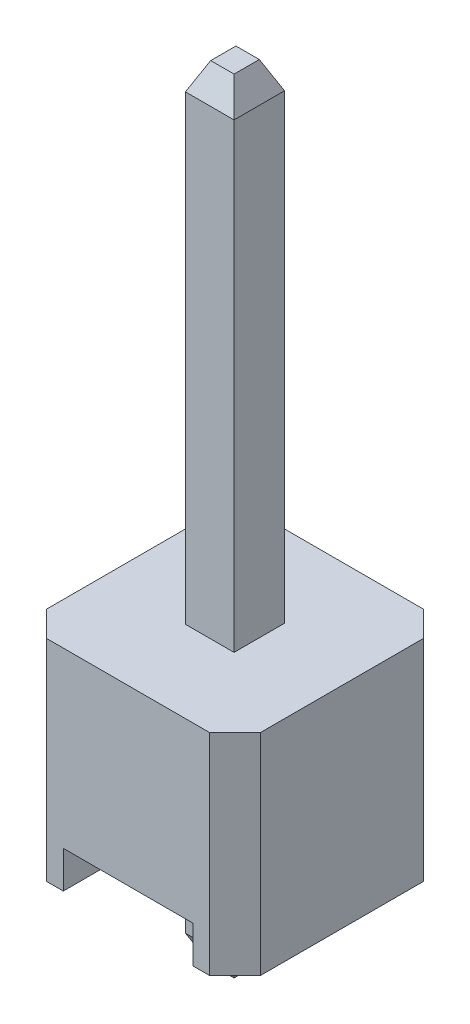
ISO-10303-21;
HEADER;
FILE_DESCRIPTION(('STEP AP214'),'2;1');
FILE_NAME('part.step','',(''),(''),'','','');
FILE_SCHEMA(('AUTOMOTIVE_DESIGN { 1 0 10303 214 1 1 1 1 }'));
ENDSEC;
DATA;
#1=APPLICATION_CONTEXT('core data for automotive mechanical design processes');
#2=APPLICATION_PROTOCOL_DEFINITION('international standard','automotive_design',2000,#1);
#3=PRODUCT_CONTEXT('',#1,'mechanical');
#4=PRODUCT('Part','Part','',(#3));
#5=PRODUCT_RELATED_PRODUCT_CATEGORY('part','',(#4));
#6=PRODUCT_DEFINITION_FORMATION('','',#4);
#7=PRODUCT_DEFINITION_CONTEXT('part definition',#1,'design');
#8=PRODUCT_DEFINITION('design','',#6,#7);
#9=PRODUCT_DEFINITION_SHAPE('','',#8);
#10=(LENGTH_UNIT() NAMED_UNIT(*) SI_UNIT(.MILLI.,.METRE.));
#11=(NAMED_UNIT(*) PLANE_ANGLE_UNIT() SI_UNIT($,.RADIAN.));
#12=(NAMED_UNIT(*) SI_UNIT($,.STERADIAN.) SOLID_ANGLE_UNIT());
#13=UNCERTAINTY_MEASURE_WITH_UNIT(LENGTH_MEASURE(1.E-05),#10,'distance_accuracy_value','');
#14=(GEOMETRIC_REPRESENTATION_CONTEXT(3) GLOBAL_UNCERTAINTY_ASSIGNED_CONTEXT((#13)) GLOBAL_UNIT_ASSIGNED_CONTEXT((#10,
#11,#12)) REPRESENTATION_CONTEXT('',''));
#15=CARTESIAN_POINT('',(0.,0.,0.));
#16=DIRECTION('',(0.,0.,1.));
#17=DIRECTION('',(1.,0.,0.));
#18=AXIS2_PLACEMENT_3D('',#15,#16,#17);
#19=CARTESIAN_POINT('',(-19.1812561045914,-5.69124998633488,0.951627111171994));
#20=DIRECTION('',(0.,-1.,0.));
#21=DIRECTION('',(0.,0.,-1.));
#22=AXIS2_PLACEMENT_3D('',#19,#20,#21);
#23=PLANE('',#22);
#24=DIRECTION('',(0.,0.,1.));
#25=VECTOR('',#24,1.);
#26=CARTESIAN_POINT('',(-19.0312561045914,-5.69124998633488,1.55162711117199));
#27=LINE('',#26,#25);
#28=CARTESIAN_POINT('',(-19.0312561045914,-5.69124998633488,1.40162711117199));
#29=VERTEX_POINT('',#28);
#30=CARTESIAN_POINT('',(-19.0312561045914,-5.69124998633488,1.10162711117199));
#31=VERTEX_POINT('',#30);
#32=EDGE_CURVE('E194',#29,#31,#27,.F.);
#33=ORIENTED_EDGE('',*,*,#32,.T.);
#34=DIRECTION('',(1.,0.,0.));
#35=VECTOR('',#34,1.);
#36=CARTESIAN_POINT('',(-19.1812561045914,-5.69124998633488,1.10162711117199));
#37=LINE('',#36,#35);
#38=CARTESIAN_POINT('',(-18.7537499744834,-5.69124998633488,1.10162711117199));
#39=VERTEX_POINT('',#38);
#40=EDGE_CURVE('E179',#31,#39,#37,.T.);
#41=ORIENTED_EDGE('',*,*,#40,.T.);
#42=DIRECTION('',(0.,0.,1.));
#43=VECTOR('',#42,1.);
#44=CARTESIAN_POINT('',(-18.7537499744834,-5.69124998633488,0.951627111171994));
#45=LINE('',#44,#43);
#46=CARTESIAN_POINT('',(-18.7537499744834,-5.69124998633488,1.40162711117199));
#47=VERTEX_POINT('',#46);
#48=EDGE_CURVE('E20',#39,#47,#45,.T.);
#49=ORIENTED_EDGE('',*,*,#48,.T.);
#50=DIRECTION('',(1.,0.,0.));
#51=VECTOR('',#50,1.);
#52=CARTESIAN_POINT('',(-18.6037499744834,-5.69124998633488,1.40162711117199));
#53=LINE('',#52,#51);
#54=EDGE_CURVE('E174',#47,#29,#53,.F.);
#55=ORIENTED_EDGE('',*,*,#54,.T.);
#56=EDGE_LOOP('',(#33,#41,#49,#55));
#57=FACE_BOUND('',#56,.T.);
#58=ADVANCED_FACE('F17',(#57),#23,.T.);
#59=CARTESIAN_POINT('',(-18.6037499744834,-5.36957394825845,0.951627111171994));
#60=DIRECTION('',(-0.90630778703665,0.4226182617407,0.));
#61=DIRECTION('',(-0.4226182617407,-0.90630778703665,0.));
#62=AXIS2_PLACEMENT_3D('',#59,#60,#61);
#63=PLANE('',#62);
#64=DIRECTION('',(0.,0.,-1.));
#65=VECTOR('',#64,1.);
#66=CARTESIAN_POINT('',(-18.6037499744834,-5.36957394825845,0.951627111171994));
#67=LINE('',#66,#65);
#68=CARTESIAN_POINT('',(-18.6037499744834,-5.36957394825845,1.55162711117199));
#69=VERTEX_POINT('',#68);
#70=CARTESIAN_POINT('',(-18.6037499744834,-5.36957394825845,0.951627111171994));
#71=VERTEX_POINT('',#70);
#72=EDGE_CURVE('E186',#69,#71,#67,.T.);
#73=ORIENTED_EDGE('',*,*,#72,.F.);
#74=DIRECTION('',(-0.389281620635035,-0.834817129478983,-0.389281620635025));
#75=VECTOR('',#74,1.);
#76=CARTESIAN_POINT('',(-18.6037499744834,-5.36957394825845,1.55162711117199));
#77=LINE('',#76,#75);
#78=EDGE_CURVE('E182',#69,#47,#77,.T.);
#79=ORIENTED_EDGE('',*,*,#78,.T.);
#80=ORIENTED_EDGE('',*,*,#48,.F.);
#81=DIRECTION('',(0.389281620635035,0.834817129478983,-0.389281620635025));
#82=VECTOR('',#81,1.);
#83=CARTESIAN_POINT('',(-18.7537499744834,-5.69124998633488,1.10162711117199));
#84=LINE('',#83,#82);
#85=EDGE_CURVE('E202',#39,#71,#84,.T.);
#86=ORIENTED_EDGE('',*,*,#85,.T.);
#87=EDGE_LOOP('',(#73,#79,#80,#86));
#88=FACE_BOUND('',#87,.T.);
#89=ADVANCED_FACE('F184',(#88),#63,.F.);
#90=CARTESIAN_POINT('',(-18.6037499744834,-5.36957394825845,1.55162711117199));
#91=DIRECTION('',(0.,0.422618261740701,-0.906307787036649));
#92=DIRECTION('',(0.,0.906307787036649,0.422618261740701));
#93=AXIS2_PLACEMENT_3D('',#90,#91,#92);
#94=PLANE('',#93);
#95=ORIENTED_EDGE('',*,*,#54,.F.);
#96=ORIENTED_EDGE('',*,*,#78,.F.);
#97=DIRECTION('',(1.,0.,0.));
#98=VECTOR('',#97,1.);
#99=CARTESIAN_POINT('',(-18.6037499744834,-5.36957394825845,1.55162711117199));
#100=LINE('',#99,#98);
#101=CARTESIAN_POINT('',(-19.1812561045914,-5.36957394825845,1.55162711117199));
#102=VERTEX_POINT('',#101);
#103=EDGE_CURVE('E205',#102,#69,#100,.T.);
#104=ORIENTED_EDGE('',*,*,#103,.F.);
#105=DIRECTION('',(0.389281620635027,-0.834817129478987,-0.389281620635025));
#106=VECTOR('',#105,1.);
#107=CARTESIAN_POINT('',(-19.1812561045914,-5.36957394825845,1.55162711117199));
#108=LINE('',#107,#106);
#109=EDGE_CURVE('E191',#102,#29,#108,.T.);
#110=ORIENTED_EDGE('',*,*,#109,.T.);
#111=EDGE_LOOP('',(#95,#96,#104,#110));
#112=FACE_BOUND('',#111,.T.);
#113=ADVANCED_FACE('F189',(#112),#94,.F.);
#114=CARTESIAN_POINT('',(-19.1812561045914,-5.36957394825845,1.55162711117199));
#115=DIRECTION('',(0.906307787036649,0.422618261740701,0.));
#116=DIRECTION('',(-0.422618261740701,0.906307787036649,0.));
#117=AXIS2_PLACEMENT_3D('',#114,#115,#116);
#118=PLANE('',#117);
#119=ORIENTED_EDGE('',*,*,#32,.F.);
#120=ORIENTED_EDGE('',*,*,#109,.F.);
#121=DIRECTION('',(0.,0.,1.));
#122=VECTOR('',#121,1.);
#123=CARTESIAN_POINT('',(-19.1812561045914,-5.36957394825845,1.55162711117199));
#124=LINE('',#123,#122);
#125=CARTESIAN_POINT('',(-19.1812561045914,-5.36957394825845,0.951627111171994));
#126=VERTEX_POINT('',#125);
#127=EDGE_CURVE('E211',#126,#102,#124,.T.);
#128=ORIENTED_EDGE('',*,*,#127,.F.);
#129=DIRECTION('',(0.389281620635027,-0.834817129478986,0.389281620635026));
#130=VECTOR('',#129,1.);
#131=CARTESIAN_POINT('',(-19.1812561045914,-5.36957394825845,0.951627111171994));
#132=LINE('',#131,#130);
#133=EDGE_CURVE('E198',#126,#31,#132,.T.);
#134=ORIENTED_EDGE('',*,*,#133,.T.);
#135=EDGE_LOOP('',(#119,#120,#128,#134));
#136=FACE_BOUND('',#135,.T.);
#137=ADVANCED_FACE('F518',(#136),#118,.F.);
#138=CARTESIAN_POINT('',(-19.1812561045914,-5.36957394825845,0.951627111171994));
#139=DIRECTION('',(0.,0.422618261740701,0.906307787036649));
#140=DIRECTION('',(0.,-0.906307787036649,0.422618261740701));
#141=AXIS2_PLACEMENT_3D('',#138,#139,#140);
#142=PLANE('',#141);
#143=ORIENTED_EDGE('',*,*,#40,.F.);
#144=ORIENTED_EDGE('',*,*,#133,.F.);
#145=DIRECTION('',(-1.,0.,0.));
#146=VECTOR('',#145,1.);
#147=CARTESIAN_POINT('',(-19.1812561045914,-5.36957394825845,0.951627111171994));
#148=LINE('',#147,#146);
#149=EDGE_CURVE('E220',#71,#126,#148,.T.);
#150=ORIENTED_EDGE('',*,*,#149,.F.);
#151=ORIENTED_EDGE('',*,*,#85,.F.);
#152=EDGE_LOOP('',(#143,#144,#150,#151));
#153=FACE_BOUND('',#152,.T.);
#154=ADVANCED_FACE('F514',(#153),#142,.F.);
#155=CARTESIAN_POINT('',(-18.6037499744834,-5.69124998633488,0.951627111171994));
#156=DIRECTION('',(1.,0.,0.));
#157=DIRECTION('',(0.,0.,-1.));
#158=AXIS2_PLACEMENT_3D('',#155,#156,#157);
#159=PLANE('',#158);
#160=DIRECTION('',(0.,1.,0.));
#161=VECTOR('',#160,1.);
#162=CARTESIAN_POINT('',(-18.6037499744834,-5.69124998633488,0.951627111171994));
#163=LINE('',#162,#161);
#164=CARTESIAN_POINT('',(-18.6037499744834,-4.25124998633488,0.951627111171994));
#165=VERTEX_POINT('',#164);
#166=EDGE_CURVE('E217',#165,#71,#163,.F.);
#167=ORIENTED_EDGE('',*,*,#166,.F.);
#168=DIRECTION('',(0.,0.,1.));
#169=VECTOR('',#168,1.);
#170=CARTESIAN_POINT('',(-18.6037499744834,-4.25124998633488,2.52162711117199));
#171=LINE('',#170,#169);
#172=CARTESIAN_POINT('',(-18.6037499744834,-4.25124998633488,1.55162711117199));
#173=VERTEX_POINT('',#172);
#174=EDGE_CURVE('E230',#165,#173,#171,.T.);
#175=ORIENTED_EDGE('',*,*,#174,.T.);
#176=DIRECTION('',(0.,1.,0.));
#177=VECTOR('',#176,1.);
#178=CARTESIAN_POINT('',(-18.6037499744834,-5.69124998633488,1.55162711117199));
#179=LINE('',#178,#177);
#180=EDGE_CURVE('E208',#69,#173,#179,.T.);
#181=ORIENTED_EDGE('',*,*,#180,.F.);
#182=ORIENTED_EDGE('',*,*,#72,.T.);
#183=EDGE_LOOP('',(#167,#175,#181,#182));
#184=FACE_BOUND('',#183,.T.);
#185=ADVANCED_FACE('F510',(#184),#159,.T.);
#186=CARTESIAN_POINT('',(-18.6037499744834,-5.69124998633488,1.55162711117199));
#187=DIRECTION('',(0.,0.,1.));
#188=DIRECTION('',(1.,0.,0.));
#189=AXIS2_PLACEMENT_3D('',#186,#187,#188);
#190=PLANE('',#189);
#191=ORIENTED_EDGE('',*,*,#180,.T.);
#192=DIRECTION('',(1.,0.,0.));
#193=VECTOR('',#192,1.);
#194=CARTESIAN_POINT('',(-18.1225030395374,-4.25124998633488,1.55162711117199));
#195=LINE('',#194,#193);
#196=CARTESIAN_POINT('',(-19.1812561045914,-4.25124998633488,1.55162711117199));
#197=VERTEX_POINT('',#196);
#198=EDGE_CURVE('E232',#173,#197,#195,.F.);
#199=ORIENTED_EDGE('',*,*,#198,.T.);
#200=DIRECTION('',(0.,1.,0.));
#201=VECTOR('',#200,1.);
#202=CARTESIAN_POINT('',(-19.1812561045914,-5.69124998633488,1.55162711117199));
#203=LINE('',#202,#201);
#204=EDGE_CURVE('E214',#102,#197,#203,.T.);
#205=ORIENTED_EDGE('',*,*,#204,.F.);
#206=ORIENTED_EDGE('',*,*,#103,.T.);
#207=EDGE_LOOP('',(#191,#199,#205,#206));
#208=FACE_BOUND('',#207,.T.);
#209=ADVANCED_FACE('F506',(#208),#190,.T.);
#210=CARTESIAN_POINT('',(-19.1812561045914,-5.69124998633488,1.55162711117199));
#211=DIRECTION('',(-1.,0.,0.));
#212=DIRECTION('',(0.,0.,1.));
#213=AXIS2_PLACEMENT_3D('',#210,#211,#212);
#214=PLANE('',#213);
#215=ORIENTED_EDGE('',*,*,#204,.T.);
#216=DIRECTION('',(0.,0.,1.));
#217=VECTOR('',#216,1.);
#218=CARTESIAN_POINT('',(-19.1812561045914,-4.25124998633488,2.52162711117199));
#219=LINE('',#218,#217);
#220=CARTESIAN_POINT('',(-19.1812561045914,-4.25124998633488,0.951627111171994));
#221=VERTEX_POINT('',#220);
#222=EDGE_CURVE('E234',#197,#221,#219,.F.);
#223=ORIENTED_EDGE('',*,*,#222,.T.);
#224=DIRECTION('',(0.,1.,0.));
#225=VECTOR('',#224,1.);
#226=CARTESIAN_POINT('',(-19.1812561045914,-5.69124998633488,0.951627111171994));
#227=LINE('',#226,#225);
#228=EDGE_CURVE('E223',#126,#221,#227,.T.);
#229=ORIENTED_EDGE('',*,*,#228,.F.);
#230=ORIENTED_EDGE('',*,*,#127,.T.);
#231=EDGE_LOOP('',(#215,#223,#229,#230));
#232=FACE_BOUND('',#231,.T.);
#233=ADVANCED_FACE('F502',(#232),#214,.T.);
#234=CARTESIAN_POINT('',(-19.1812561045914,-5.69124998633488,0.951627111171994));
#235=DIRECTION('',(0.,0.,-1.));
#236=DIRECTION('',(-1.,0.,0.));
#237=AXIS2_PLACEMENT_3D('',#234,#235,#236);
#238=PLANE('',#237);
#239=ORIENTED_EDGE('',*,*,#228,.T.);
#240=DIRECTION('',(1.,0.,0.));
#241=VECTOR('',#240,1.);
#242=CARTESIAN_POINT('',(-18.1225030395374,-4.25124998633488,0.951627111171994));
#243=LINE('',#242,#241);
#244=EDGE_CURVE('E236',#221,#165,#243,.T.);
#245=ORIENTED_EDGE('',*,*,#244,.T.);
#246=ORIENTED_EDGE('',*,*,#166,.T.);
#247=ORIENTED_EDGE('',*,*,#149,.T.);
#248=EDGE_LOOP('',(#239,#245,#246,#247));
#249=FACE_BOUND('',#248,.T.);
#250=ADVANCED_FACE('F498',(#249),#238,.T.);
#251=CARTESIAN_POINT('',(-18.1225030395374,-4.25124998633488,2.52162711117199));
#252=DIRECTION('',(0.,1.,0.));
#253=DIRECTION('',(0.,0.,1.));
#254=AXIS2_PLACEMENT_3D('',#251,#252,#253);
#255=PLANE('',#254);
#256=ORIENTED_EDGE('',*,*,#222,.F.);
#257=ORIENTED_EDGE('',*,*,#198,.F.);
#258=ORIENTED_EDGE('',*,*,#174,.F.);
#259=ORIENTED_EDGE('',*,*,#244,.F.);
#260=EDGE_LOOP('',(#256,#257,#258,#259));
#261=FACE_BOUND('',#260,.T.);
#262=DIRECTION('',(0.,0.,1.));
#263=VECTOR('',#262,1.);
#264=CARTESIAN_POINT('',(-19.6625030395374,-4.25124998633488,2.52162711117199));
#265=LINE('',#264,#263);
#266=CARTESIAN_POINT('',(-19.6625030395374,-4.25124998633488,2.52162711117199));
#267=VERTEX_POINT('',#266);
#268=CARTESIAN_POINT('',(-19.6625030395374,-4.25124998633488,-0.0183728888280069));
#269=VERTEX_POINT('',#268);
#270=EDGE_CURVE('E241',#267,#269,#265,.F.);
#271=ORIENTED_EDGE('',*,*,#270,.T.);
#272=DIRECTION('',(1.,0.,0.));
#273=VECTOR('',#272,1.);
#274=CARTESIAN_POINT('',(-18.1225030395374,-4.25124998633488,-0.0183728888280069));
#275=LINE('',#274,#273);
#276=CARTESIAN_POINT('',(-18.1225030395374,-4.25124998633488,-0.0183728888280069));
#277=VERTEX_POINT('',#276);
#278=EDGE_CURVE('E226',#277,#269,#275,.F.);
#279=ORIENTED_EDGE('',*,*,#278,.F.);
#280=DIRECTION('',(0.,0.,-1.));
#281=VECTOR('',#280,1.);
#282=CARTESIAN_POINT('',(-18.1225030395374,-4.25124998633488,2.52162711117199));
#283=LINE('',#282,#281);
#284=CARTESIAN_POINT('',(-18.1225030395374,-4.25124998633488,2.52162711117199));
#285=VERTEX_POINT('',#284);
#286=EDGE_CURVE('E248',#277,#285,#283,.F.);
#287=ORIENTED_EDGE('',*,*,#286,.T.);
#288=DIRECTION('',(1.,0.,0.));
#289=VECTOR('',#288,1.);
#290=CARTESIAN_POINT('',(-18.1225030395374,-4.25124998633488,2.52162711117199));
#291=LINE('',#290,#289);
#292=EDGE_CURVE('E228',#267,#285,#291,.T.);
#293=ORIENTED_EDGE('',*,*,#292,.F.);
#294=EDGE_LOOP('',(#271,#279,#287,#293));
#295=FACE_BOUND('',#294,.T.);
#296=ADVANCED_FACE('F495',(#261,#295),#255,.F.);
#297=CARTESIAN_POINT('',(-19.1812561045914,3.60875001366512,1.10162711117199));
#298=DIRECTION('',(0.,0.422618261740697,-0.906307787036651));
#299=DIRECTION('',(0.,0.906307787036651,0.422618261740697));
#300=AXIS2_PLACEMENT_3D('',#297,#298,#299);
#301=PLANE('',#300);
#302=DIRECTION('',(-0.389281620635024,-0.83481712947899,-0.389281620635022));
#303=VECTOR('',#302,1.);
#304=CARTESIAN_POINT('',(-19.0312561045914,3.60875001366512,1.10162711117199));
#305=LINE('',#304,#303);
#306=CARTESIAN_POINT('',(-19.0312561045914,3.60875001366512,1.10162711117199));
#307=VERTEX_POINT('',#306);
#308=CARTESIAN_POINT('',(-19.1812561045914,3.28707397558869,0.951627111171994));
#309=VERTEX_POINT('',#308);
#310=EDGE_CURVE('E263',#307,#309,#305,.T.);
#311=ORIENTED_EDGE('',*,*,#310,.F.);
#312=DIRECTION('',(1.,0.,0.));
#313=VECTOR('',#312,1.);
#314=CARTESIAN_POINT('',(-19.1812561045914,3.60875001366512,1.10162711117199));
#315=LINE('',#314,#313);
#316=CARTESIAN_POINT('',(-18.7537499744834,3.60875001366512,1.10162711117199));
#317=VERTEX_POINT('',#316);
#318=EDGE_CURVE('E256',#307,#317,#315,.T.);
#319=ORIENTED_EDGE('',*,*,#318,.T.);
#320=DIRECTION('',(-0.389281620635023,0.83481712947899,0.389281620635021));
#321=VECTOR('',#320,1.);
#322=CARTESIAN_POINT('',(-18.6037499744834,3.28707397558868,0.951627111171994));
#323=LINE('',#322,#321);
#324=CARTESIAN_POINT('',(-18.6037499744834,3.28707397558869,0.951627111171994));
#325=VERTEX_POINT('',#324);
#326=EDGE_CURVE('E253',#325,#317,#323,.T.);
#327=ORIENTED_EDGE('',*,*,#326,.F.);
#328=DIRECTION('',(-1.,0.,0.));
#329=VECTOR('',#328,1.);
#330=CARTESIAN_POINT('',(-19.1812561045914,3.28707397558869,0.951627111171994));
#331=LINE('',#330,#329);
#332=EDGE_CURVE('E266',#309,#325,#331,.F.);
#333=ORIENTED_EDGE('',*,*,#332,.F.);
#334=EDGE_LOOP('',(#311,#319,#327,#333));
#335=FACE_BOUND('',#334,.T.);
#336=ADVANCED_FACE('F472',(#335),#301,.T.);
#337=CARTESIAN_POINT('',(-19.6625030395374,-4.25124998633488,2.52162711117199));
#338=DIRECTION('',(-1.,0.,0.));
#339=DIRECTION('',(0.,0.,1.));
#340=AXIS2_PLACEMENT_3D('',#337,#338,#339);
#341=PLANE('',#340);
#342=DIRECTION('',(0.,1.,0.));
#343=VECTOR('',#342,1.);
#344=CARTESIAN_POINT('',(-19.6625030395374,-4.25124998633488,-0.0183728888280069));
#345=LINE('',#344,#343);
#346=CARTESIAN_POINT('',(-19.6625030395374,-4.69124998633488,-0.0183728888280069));
#347=VERTEX_POINT('',#346);
#348=EDGE_CURVE('E244',#269,#347,#345,.F.);
#349=ORIENTED_EDGE('',*,*,#348,.F.);
#350=ORIENTED_EDGE('',*,*,#270,.F.);
#351=DIRECTION('',(0.,1.,0.));
#352=VECTOR('',#351,1.);
#353=CARTESIAN_POINT('',(-19.6625030395374,-4.25124998633488,2.52162711117199));
#354=LINE('',#353,#352);
#355=CARTESIAN_POINT('',(-19.6625030395374,-4.69124998633488,2.52162711117199));
#356=VERTEX_POINT('',#355);
#357=EDGE_CURVE('E239',#356,#267,#354,.T.);
#358=ORIENTED_EDGE('',*,*,#357,.F.);
#359=DIRECTION('',(0.,0.,1.));
#360=VECTOR('',#359,1.);
#361=CARTESIAN_POINT('',(-19.6625030395374,-4.69124998633488,1.25162711117199));
#362=LINE('',#361,#360);
#363=EDGE_CURVE('E273',#356,#347,#362,.F.);
#364=ORIENTED_EDGE('',*,*,#363,.T.);
#365=EDGE_LOOP('',(#349,#350,#358,#364));
#366=FACE_BOUND('',#365,.T.);
#367=ADVANCED_FACE('F488',(#366),#341,.F.);
#368=CARTESIAN_POINT('',(-18.1225030395374,-4.25124998633488,2.52162711117199));
#369=DIRECTION('',(1.,0.,0.));
#370=DIRECTION('',(0.,0.,-1.));
#371=AXIS2_PLACEMENT_3D('',#368,#369,#370);
#372=PLANE('',#371);
#373=DIRECTION('',(0.,1.,0.));
#374=VECTOR('',#373,1.);
#375=CARTESIAN_POINT('',(-18.1225030395374,-4.25124998633488,2.52162711117199));
#376=LINE('',#375,#374);
#377=CARTESIAN_POINT('',(-18.1225030395374,-4.69124998633488,2.52162711117199));
#378=VERTEX_POINT('',#377);
#379=EDGE_CURVE('E251',#285,#378,#376,.F.);
#380=ORIENTED_EDGE('',*,*,#379,.F.);
#381=ORIENTED_EDGE('',*,*,#286,.F.);
#382=DIRECTION('',(0.,1.,0.));
#383=VECTOR('',#382,1.);
#384=CARTESIAN_POINT('',(-18.1225030395374,-4.25124998633488,-0.0183728888280069));
#385=LINE('',#384,#383);
#386=CARTESIAN_POINT('',(-18.1225030395374,-4.69124998633488,-0.018372888828007));
#387=VERTEX_POINT('',#386);
#388=EDGE_CURVE('E246',#387,#277,#385,.T.);
#389=ORIENTED_EDGE('',*,*,#388,.F.);
#390=DIRECTION('',(0.,0.,1.));
#391=VECTOR('',#390,1.);
#392=CARTESIAN_POINT('',(-18.1225030395374,-4.69124998633488,1.25162711117199));
#393=LINE('',#392,#391);
#394=EDGE_CURVE('E288',#387,#378,#393,.T.);
#395=ORIENTED_EDGE('',*,*,#394,.T.);
#396=EDGE_LOOP('',(#380,#381,#389,#395));
#397=FACE_BOUND('',#396,.T.);
#398=ADVANCED_FACE('F482',(#397),#372,.F.);
#399=CARTESIAN_POINT('',(-18.7537499744834,3.60875001366512,0.951627111171993));
#400=DIRECTION('',(0.906307787036651,0.422618261740697,0.));
#401=DIRECTION('',(-0.422618261740697,0.906307787036651,0.));
#402=AXIS2_PLACEMENT_3D('',#399,#400,#401);
#403=PLANE('',#402);
#404=ORIENTED_EDGE('',*,*,#326,.T.);
#405=DIRECTION('',(0.,0.,-1.));
#406=VECTOR('',#405,1.);
#407=CARTESIAN_POINT('',(-18.7537499744834,3.60875001366512,0.951627111171994));
#408=LINE('',#407,#406);
#409=CARTESIAN_POINT('',(-18.7537499744834,3.60875001366512,1.40162711117199));
#410=VERTEX_POINT('',#409);
#411=EDGE_CURVE('E258',#317,#410,#408,.F.);
#412=ORIENTED_EDGE('',*,*,#411,.T.);
#413=DIRECTION('',(-0.389281620635032,0.834817129478986,-0.389281620635021));
#414=VECTOR('',#413,1.);
#415=CARTESIAN_POINT('',(-18.6037499744834,3.28707397558869,1.55162711117199));
#416=LINE('',#415,#414);
#417=CARTESIAN_POINT('',(-18.6037499744834,3.28707397558869,1.55162711117199));
#418=VERTEX_POINT('',#417);
#419=EDGE_CURVE('E310',#418,#410,#416,.T.);
#420=ORIENTED_EDGE('',*,*,#419,.F.);
#421=DIRECTION('',(0.,0.,-1.));
#422=VECTOR('',#421,1.);
#423=CARTESIAN_POINT('',(-18.6037499744834,3.28707397558869,0.951627111171994));
#424=LINE('',#423,#422);
#425=EDGE_CURVE('E303',#325,#418,#424,.F.);
#426=ORIENTED_EDGE('',*,*,#425,.F.);
#427=EDGE_LOOP('',(#404,#412,#420,#426));
#428=FACE_BOUND('',#427,.T.);
#429=ADVANCED_FACE('F466',(#428),#403,.T.);
#430=CARTESIAN_POINT('',(-19.1812561045914,3.60875001366512,0.951627111171994));
#431=DIRECTION('',(0.,-1.,0.));
#432=DIRECTION('',(0.,0.,-1.));
#433=AXIS2_PLACEMENT_3D('',#430,#431,#432);
#434=PLANE('',#433);
#435=ORIENTED_EDGE('',*,*,#318,.F.);
#436=DIRECTION('',(0.,0.,1.));
#437=VECTOR('',#436,1.);
#438=CARTESIAN_POINT('',(-19.0312561045914,3.60875001366512,0.951627111171994));
#439=LINE('',#438,#437);
#440=CARTESIAN_POINT('',(-19.0312561045914,3.60875001366512,1.40162711117199));
#441=VERTEX_POINT('',#440);
#442=EDGE_CURVE('E260',#441,#307,#439,.F.);
#443=ORIENTED_EDGE('',*,*,#442,.F.);
#444=DIRECTION('',(1.,0.,0.));
#445=VECTOR('',#444,1.);
#446=CARTESIAN_POINT('',(-19.1812561045914,3.60875001366512,1.40162711117199));
#447=LINE('',#446,#445);
#448=EDGE_CURVE('E313',#410,#441,#447,.F.);
#449=ORIENTED_EDGE('',*,*,#448,.F.);
#450=ORIENTED_EDGE('',*,*,#411,.F.);
#451=EDGE_LOOP('',(#435,#443,#449,#450));
#452=FACE_BOUND('',#451,.T.);
#453=ADVANCED_FACE('F474',(#452),#434,.F.);
#454=CARTESIAN_POINT('',(-19.0312561045914,3.60875001366512,0.951627111171994));
#455=DIRECTION('',(-0.906307787036651,0.422618261740697,0.));
#456=DIRECTION('',(-0.422618261740697,-0.906307787036651,0.));
#457=AXIS2_PLACEMENT_3D('',#454,#455,#456);
#458=PLANE('',#457);
#459=ORIENTED_EDGE('',*,*,#310,.T.);
#460=DIRECTION('',(0.,0.,1.));
#461=VECTOR('',#460,1.);
#462=CARTESIAN_POINT('',(-19.1812561045914,3.28707397558869,1.55162711117199));
#463=LINE('',#462,#461);
#464=CARTESIAN_POINT('',(-19.1812561045914,3.28707397558869,1.55162711117199));
#465=VERTEX_POINT('',#464);
#466=EDGE_CURVE('E316',#465,#309,#463,.F.);
#467=ORIENTED_EDGE('',*,*,#466,.F.);
#468=DIRECTION('',(-0.389281620635025,-0.834817129478989,0.389281620635023));
#469=VECTOR('',#468,1.);
#470=CARTESIAN_POINT('',(-19.0312561045914,3.60875001366512,1.40162711117199));
#471=LINE('',#470,#469);
#472=EDGE_CURVE('E307',#441,#465,#471,.T.);
#473=ORIENTED_EDGE('',*,*,#472,.F.);
#474=ORIENTED_EDGE('',*,*,#442,.T.);
#475=EDGE_LOOP('',(#459,#467,#473,#474));
#476=FACE_BOUND('',#475,.T.);
#477=ADVANCED_FACE('F471',(#476),#458,.T.);
#478=CARTESIAN_POINT('',(-19.1812561045914,-5.69124998633488,0.951627111171994));
#479=DIRECTION('',(0.,0.,-1.));
#480=DIRECTION('',(-1.,0.,0.));
#481=AXIS2_PLACEMENT_3D('',#478,#479,#480);
#482=PLANE('',#481);
#483=DIRECTION('',(0.,1.,0.));
#484=VECTOR('',#483,1.);
#485=CARTESIAN_POINT('',(-18.6037499744834,-5.69124998633488,0.951627111171994));
#486=LINE('',#485,#484);
#487=CARTESIAN_POINT('',(-18.6037499744834,-2.19124998633488,0.951627111171994));
#488=VERTEX_POINT('',#487);
#489=EDGE_CURVE('E300',#488,#325,#486,.T.);
#490=ORIENTED_EDGE('',*,*,#489,.F.);
#491=DIRECTION('',(-1.,0.,0.));
#492=VECTOR('',#491,1.);
#493=CARTESIAN_POINT('',(-19.1812561045914,-2.19124998633488,0.951627111171994));
#494=LINE('',#493,#492);
#495=CARTESIAN_POINT('',(-19.1812561045914,-2.19124998633488,0.951627111171994));
#496=VERTEX_POINT('',#495);
#497=EDGE_CURVE('E269',#488,#496,#494,.T.);
#498=ORIENTED_EDGE('',*,*,#497,.T.);
#499=DIRECTION('',(0.,1.,0.));
#500=VECTOR('',#499,1.);
#501=CARTESIAN_POINT('',(-19.1812561045914,-5.69124998633488,0.951627111171994));
#502=LINE('',#501,#500);
#503=EDGE_CURVE('E319',#309,#496,#502,.F.);
#504=ORIENTED_EDGE('',*,*,#503,.F.);
#505=ORIENTED_EDGE('',*,*,#332,.T.);
#506=EDGE_LOOP('',(#490,#498,#504,#505));
#507=FACE_BOUND('',#506,.T.);
#508=ADVANCED_FACE('F462',(#507),#482,.T.);
#509=CARTESIAN_POINT('',(-21.1325030395374,-4.69124998633488,1.25162711117199));
#510=DIRECTION('',(0.,1.,0.));
#511=DIRECTION('',(0.,0.,1.));
#512=AXIS2_PLACEMENT_3D('',#509,#510,#511);
#513=PLANE('',#512);
#514=ORIENTED_EDGE('',*,*,#363,.F.);
#515=DIRECTION('',(1.,0.,0.));
#516=VECTOR('',#515,1.);
#517=CARTESIAN_POINT('',(-21.1325030395374,-4.69124998633488,2.52162711117199));
#518=LINE('',#517,#516);
#519=CARTESIAN_POINT('',(-19.8625030395374,-4.69124998633488,2.52162711117199));
#520=VERTEX_POINT('',#519);
#521=EDGE_CURVE('E271',#520,#356,#518,.T.);
#522=ORIENTED_EDGE('',*,*,#521,.F.);
#523=DIRECTION('',(-0.707106781186549,0.,-0.707106781186546));
#524=VECTOR('',#523,1.);
#525=CARTESIAN_POINT('',(-20.1625030395374,-4.69124998633488,2.22162711117199));
#526=LINE('',#525,#524);
#527=CARTESIAN_POINT('',(-20.1625030395374,-4.69124998633488,2.22162711117199));
#528=VERTEX_POINT('',#527);
#529=EDGE_CURVE('E280',#520,#528,#526,.T.);
#530=ORIENTED_EDGE('',*,*,#529,.T.);
#531=DIRECTION('',(0.,0.,-1.));
#532=VECTOR('',#531,1.);
#533=CARTESIAN_POINT('',(-20.1625030395374,-4.69124998633488,0.281627111171992));
#534=LINE('',#533,#532);
#535=CARTESIAN_POINT('',(-20.1625030395374,-4.69124998633488,0.281627111171992));
#536=VERTEX_POINT('',#535);
#537=EDGE_CURVE('E330',#528,#536,#534,.T.);
#538=ORIENTED_EDGE('',*,*,#537,.T.);
#539=DIRECTION('',(0.707106781186549,0.,-0.707106781186546));
#540=VECTOR('',#539,1.);
#541=CARTESIAN_POINT('',(-19.8625030395374,-4.69124998633488,-0.018372888828007));
#542=LINE('',#541,#540);
#543=CARTESIAN_POINT('',(-19.8625030395374,-4.69124998633488,-0.018372888828007));
#544=VERTEX_POINT('',#543);
#545=EDGE_CURVE('E297',#536,#544,#542,.T.);
#546=ORIENTED_EDGE('',*,*,#545,.T.);
#547=DIRECTION('',(1.,0.,0.));
#548=VECTOR('',#547,1.);
#549=CARTESIAN_POINT('',(-21.1325030395374,-4.69124998633488,-0.0183728888280071));
#550=LINE('',#549,#548);
#551=EDGE_CURVE('E276',#347,#544,#550,.F.);
#552=ORIENTED_EDGE('',*,*,#551,.F.);
#553=EDGE_LOOP('',(#514,#522,#530,#538,#546,#552));
#554=FACE_BOUND('',#553,.T.);
#555=ADVANCED_FACE('F630',(#554),#513,.F.);
#556=CARTESIAN_POINT('',(-20.1625030395374,-2.19124998633488,2.22162711117199));
#557=DIRECTION('',(0.707106781186546,0.,-0.707106781186549));
#558=DIRECTION('',(-0.707106781186549,0.,-0.707106781186546));
#559=AXIS2_PLACEMENT_3D('',#556,#557,#558);
#560=PLANE('',#559);
#561=DIRECTION('',(0.,1.,0.));
#562=VECTOR('',#561,1.);
#563=CARTESIAN_POINT('',(-19.8625030395374,-2.19124998633488,2.52162711117199));
#564=LINE('',#563,#562);
#565=CARTESIAN_POINT('',(-19.8625030395374,-2.19124998633488,2.52162711117199));
#566=VERTEX_POINT('',#565);
#567=EDGE_CURVE('E333',#520,#566,#564,.T.);
#568=ORIENTED_EDGE('',*,*,#567,.T.);
#569=DIRECTION('',(-0.707106781186549,0.,-0.707106781186546));
#570=VECTOR('',#569,1.);
#571=CARTESIAN_POINT('',(-20.1625030395374,-2.19124998633488,2.22162711117199));
#572=LINE('',#571,#570);
#573=CARTESIAN_POINT('',(-20.1625030395374,-2.19124998633488,2.22162711117199));
#574=VERTEX_POINT('',#573);
#575=EDGE_CURVE('E278',#574,#566,#572,.F.);
#576=ORIENTED_EDGE('',*,*,#575,.F.);
#577=DIRECTION('',(0.,1.,0.));
#578=VECTOR('',#577,1.);
#579=CARTESIAN_POINT('',(-20.1625030395374,-2.19124998633488,2.22162711117199));
#580=LINE('',#579,#578);
#581=EDGE_CURVE('E327',#574,#528,#580,.F.);
#582=ORIENTED_EDGE('',*,*,#581,.T.);
#583=ORIENTED_EDGE('',*,*,#529,.F.);
#584=EDGE_LOOP('',(#568,#576,#582,#583));
#585=FACE_BOUND('',#584,.T.);
#586=ADVANCED_FACE('F395',(#585),#560,.F.);
#587=CARTESIAN_POINT('',(-17.9225030395374,-2.19124998633488,2.52162711117199));
#588=DIRECTION('',(-0.707106781186549,0.,-0.707106781186546));
#589=DIRECTION('',(-0.707106781186546,0.,0.707106781186549));
#590=AXIS2_PLACEMENT_3D('',#587,#588,#589);
#591=PLANE('',#590);
#592=DIRECTION('',(0.,1.,0.));
#593=VECTOR('',#592,1.);
#594=CARTESIAN_POINT('',(-17.6225030395374,-2.19124998633488,2.22162711117199));
#595=LINE('',#594,#593);
#596=CARTESIAN_POINT('',(-17.6225030395374,-4.69124998633488,2.22162711117199));
#597=VERTEX_POINT('',#596);
#598=CARTESIAN_POINT('',(-17.6225030395374,-2.19124998633488,2.22162711117199));
#599=VERTEX_POINT('',#598);
#600=EDGE_CURVE('E341',#597,#599,#595,.T.);
#601=ORIENTED_EDGE('',*,*,#600,.T.);
#602=DIRECTION('',(-0.707106781186546,0.,0.707106781186549));
#603=VECTOR('',#602,1.);
#604=CARTESIAN_POINT('',(-17.9225030395374,-2.19124998633488,2.52162711117199));
#605=LINE('',#604,#603);
#606=CARTESIAN_POINT('',(-17.9225030395374,-2.19124998633488,2.52162711117199));
#607=VERTEX_POINT('',#606);
#608=EDGE_CURVE('E282',#607,#599,#605,.F.);
#609=ORIENTED_EDGE('',*,*,#608,.F.);
#610=DIRECTION('',(0.,1.,0.));
#611=VECTOR('',#610,1.);
#612=CARTESIAN_POINT('',(-17.9225030395374,-2.19124998633488,2.52162711117199));
#613=LINE('',#612,#611);
#614=CARTESIAN_POINT('',(-17.9225030395374,-4.69124998633488,2.52162711117199));
#615=VERTEX_POINT('',#614);
#616=EDGE_CURVE('E336',#607,#615,#613,.F.);
#617=ORIENTED_EDGE('',*,*,#616,.T.);
#618=DIRECTION('',(0.707106781186545,0.,-0.70710678118655));
#619=VECTOR('',#618,1.);
#620=CARTESIAN_POINT('',(-17.9225030395374,-4.69124998633488,2.52162711117199));
#621=LINE('',#620,#619);
#622=EDGE_CURVE('E284',#615,#597,#621,.T.);
#623=ORIENTED_EDGE('',*,*,#622,.T.);
#624=EDGE_LOOP('',(#601,#609,#617,#623));
#625=FACE_BOUND('',#624,.T.);
#626=ADVANCED_FACE('F402',(#625),#591,.F.);
#627=CARTESIAN_POINT('',(-21.1325030395374,-4.69124998633488,1.25162711117199));
#628=DIRECTION('',(0.,1.,0.));
#629=DIRECTION('',(0.,0.,1.));
#630=AXIS2_PLACEMENT_3D('',#627,#628,#629);
#631=PLANE('',#630);
#632=ORIENTED_EDGE('',*,*,#394,.F.);
#633=DIRECTION('',(1.,0.,0.));
#634=VECTOR('',#633,1.);
#635=CARTESIAN_POINT('',(-21.1325030395374,-4.69124998633488,-0.0183728888280071));
#636=LINE('',#635,#634);
#637=CARTESIAN_POINT('',(-17.9225030395374,-4.69124998633488,-0.0183728888280068));
#638=VERTEX_POINT('',#637);
#639=EDGE_CURVE('E286',#638,#387,#636,.F.);
#640=ORIENTED_EDGE('',*,*,#639,.F.);
#641=DIRECTION('',(0.707106781186547,0.,0.707106781186548));
#642=VECTOR('',#641,1.);
#643=CARTESIAN_POINT('',(-17.6225030395374,-4.69124998633488,0.281627111171993));
#644=LINE('',#643,#642);
#645=CARTESIAN_POINT('',(-17.6225030395374,-4.69124998633488,0.281627111171993));
#646=VERTEX_POINT('',#645);
#647=EDGE_CURVE('E293',#638,#646,#644,.T.);
#648=ORIENTED_EDGE('',*,*,#647,.T.);
#649=DIRECTION('',(0.,0.,1.));
#650=VECTOR('',#649,1.);
#651=CARTESIAN_POINT('',(-17.6225030395374,-4.69124998633488,2.22162711117199));
#652=LINE('',#651,#650);
#653=EDGE_CURVE('E347',#646,#597,#652,.T.);
#654=ORIENTED_EDGE('',*,*,#653,.T.);
#655=ORIENTED_EDGE('',*,*,#622,.F.);
#656=DIRECTION('',(-1.,0.,0.));
#657=VECTOR('',#656,1.);
#658=CARTESIAN_POINT('',(-19.8625030395374,-4.69124998633488,2.52162711117199));
#659=LINE('',#658,#657);
#660=EDGE_CURVE('E338',#615,#378,#659,.T.);
#661=ORIENTED_EDGE('',*,*,#660,.T.);
#662=EDGE_LOOP('',(#632,#640,#648,#654,#655,#661));
#663=FACE_BOUND('',#662,.T.);
#664=ADVANCED_FACE('F405',(#663),#631,.F.);
#665=CARTESIAN_POINT('',(-17.6225030395374,-2.19124998633488,0.281627111171993));
#666=DIRECTION('',(-0.707106781186548,0.,0.707106781186547));
#667=DIRECTION('',(0.707106781186547,0.,0.707106781186548));
#668=AXIS2_PLACEMENT_3D('',#665,#666,#667);
#669=PLANE('',#668);
#670=DIRECTION('',(0.,1.,0.));
#671=VECTOR('',#670,1.);
#672=CARTESIAN_POINT('',(-17.9225030395374,-2.19124998633488,-0.018372888828007));
#673=LINE('',#672,#671);
#674=CARTESIAN_POINT('',(-17.9225030395374,-2.19124998633488,-0.0183728888280066));
#675=VERTEX_POINT('',#674);
#676=EDGE_CURVE('E350',#638,#675,#673,.T.);
#677=ORIENTED_EDGE('',*,*,#676,.T.);
#678=DIRECTION('',(0.707106781186547,0.,0.707106781186548));
#679=VECTOR('',#678,1.);
#680=CARTESIAN_POINT('',(-17.6225030395374,-2.19124998633488,0.281627111171993));
#681=LINE('',#680,#679);
#682=CARTESIAN_POINT('',(-17.6225030395374,-2.19124998633488,0.281627111171993));
#683=VERTEX_POINT('',#682);
#684=EDGE_CURVE('E291',#683,#675,#681,.F.);
#685=ORIENTED_EDGE('',*,*,#684,.F.);
#686=DIRECTION('',(0.,1.,0.));
#687=VECTOR('',#686,1.);
#688=CARTESIAN_POINT('',(-17.6225030395374,-2.19124998633488,0.281627111171993));
#689=LINE('',#688,#687);
#690=EDGE_CURVE('E344',#683,#646,#689,.F.);
#691=ORIENTED_EDGE('',*,*,#690,.T.);
#692=ORIENTED_EDGE('',*,*,#647,.F.);
#693=EDGE_LOOP('',(#677,#685,#691,#692));
#694=FACE_BOUND('',#693,.T.);
#695=ADVANCED_FACE('F414',(#694),#669,.F.);
#696=CARTESIAN_POINT('',(-19.8625030395374,-2.19124998633488,-0.018372888828007));
#697=DIRECTION('',(0.707106781186546,0.,0.707106781186549));
#698=DIRECTION('',(0.707106781186549,0.,-0.707106781186546));
#699=AXIS2_PLACEMENT_3D('',#696,#697,#698);
#700=PLANE('',#699);
#701=DIRECTION('',(0.,1.,0.));
#702=VECTOR('',#701,1.);
#703=CARTESIAN_POINT('',(-20.1625030395374,-2.19124998633488,0.281627111171992));
#704=LINE('',#703,#702);
#705=CARTESIAN_POINT('',(-20.1625030395374,-2.19124998633488,0.281627111171992));
#706=VERTEX_POINT('',#705);
#707=EDGE_CURVE('E324',#536,#706,#704,.T.);
#708=ORIENTED_EDGE('',*,*,#707,.T.);
#709=DIRECTION('',(0.707106781186549,0.,-0.707106781186546));
#710=VECTOR('',#709,1.);
#711=CARTESIAN_POINT('',(-19.8625030395374,-2.19124998633488,-0.018372888828007));
#712=LINE('',#711,#710);
#713=CARTESIAN_POINT('',(-19.8625030395374,-2.19124998633488,-0.018372888828007));
#714=VERTEX_POINT('',#713);
#715=EDGE_CURVE('E295',#714,#706,#712,.F.);
#716=ORIENTED_EDGE('',*,*,#715,.F.);
#717=DIRECTION('',(0.,1.,0.));
#718=VECTOR('',#717,1.);
#719=CARTESIAN_POINT('',(-19.8625030395374,-2.19124998633488,-0.018372888828007));
#720=LINE('',#719,#718);
#721=EDGE_CURVE('E353',#714,#544,#720,.F.);
#722=ORIENTED_EDGE('',*,*,#721,.T.);
#723=ORIENTED_EDGE('',*,*,#545,.F.);
#724=EDGE_LOOP('',(#708,#716,#722,#723));
#725=FACE_BOUND('',#724,.T.);
#726=ADVANCED_FACE('F384',(#725),#700,.F.);
#727=CARTESIAN_POINT('',(-18.6037499744834,-5.69124998633488,0.951627111171994));
#728=DIRECTION('',(1.,0.,0.));
#729=DIRECTION('',(0.,0.,-1.));
#730=AXIS2_PLACEMENT_3D('',#727,#728,#729);
#731=PLANE('',#730);
#732=DIRECTION('',(0.,1.,0.));
#733=VECTOR('',#732,1.);
#734=CARTESIAN_POINT('',(-18.6037499744834,-5.69124998633488,1.55162711117199));
#735=LINE('',#734,#733);
#736=CARTESIAN_POINT('',(-18.6037499744834,-2.19124998633488,1.55162711117199));
#737=VERTEX_POINT('',#736);
#738=EDGE_CURVE('E356',#737,#418,#735,.T.);
#739=ORIENTED_EDGE('',*,*,#738,.F.);
#740=DIRECTION('',(0.,0.,-1.));
#741=VECTOR('',#740,1.);
#742=CARTESIAN_POINT('',(-18.6037499744834,-2.19124998633488,0.951627111171994));
#743=LINE('',#742,#741);
#744=EDGE_CURVE('E34',#737,#488,#743,.T.);
#745=ORIENTED_EDGE('',*,*,#744,.T.);
#746=ORIENTED_EDGE('',*,*,#489,.T.);
#747=ORIENTED_EDGE('',*,*,#425,.T.);
#748=EDGE_LOOP('',(#739,#745,#746,#747));
#749=FACE_BOUND('',#748,.T.);
#750=ADVANCED_FACE('F422',(#749),#731,.T.);
#751=CARTESIAN_POINT('',(-19.1812561045914,3.60875001366512,1.40162711117199));
#752=DIRECTION('',(0.,0.422618261740697,0.906307787036651));
#753=DIRECTION('',(0.,-0.906307787036651,0.422618261740697));
#754=AXIS2_PLACEMENT_3D('',#751,#752,#753);
#755=PLANE('',#754);
#756=ORIENTED_EDGE('',*,*,#419,.T.);
#757=ORIENTED_EDGE('',*,*,#448,.T.);
#758=ORIENTED_EDGE('',*,*,#472,.T.);
#759=DIRECTION('',(1.,0.,0.));
#760=VECTOR('',#759,1.);
#761=CARTESIAN_POINT('',(-18.6037499744834,3.28707397558869,1.55162711117199));
#762=LINE('',#761,#760);
#763=EDGE_CURVE('E359',#418,#465,#762,.F.);
#764=ORIENTED_EDGE('',*,*,#763,.F.);
#765=EDGE_LOOP('',(#756,#757,#758,#764));
#766=FACE_BOUND('',#765,.T.);
#767=ADVANCED_FACE('F445',(#766),#755,.T.);
#768=CARTESIAN_POINT('',(-19.1812561045914,-5.69124998633488,1.55162711117199));
#769=DIRECTION('',(-1.,0.,0.));
#770=DIRECTION('',(0.,0.,1.));
#771=AXIS2_PLACEMENT_3D('',#768,#769,#770);
#772=PLANE('',#771);
#773=ORIENTED_EDGE('',*,*,#503,.T.);
#774=DIRECTION('',(0.,0.,1.));
#775=VECTOR('',#774,1.);
#776=CARTESIAN_POINT('',(-19.1812561045914,-2.19124998633488,1.55162711117199));
#777=LINE('',#776,#775);
#778=CARTESIAN_POINT('',(-19.1812561045914,-2.19124998633488,1.55162711117199));
#779=VERTEX_POINT('',#778);
#780=EDGE_CURVE('E322',#496,#779,#777,.T.);
#781=ORIENTED_EDGE('',*,*,#780,.T.);
#782=DIRECTION('',(0.,1.,0.));
#783=VECTOR('',#782,1.);
#784=CARTESIAN_POINT('',(-19.1812561045914,-5.69124998633488,1.55162711117199));
#785=LINE('',#784,#783);
#786=EDGE_CURVE('E362',#465,#779,#785,.F.);
#787=ORIENTED_EDGE('',*,*,#786,.F.);
#788=ORIENTED_EDGE('',*,*,#466,.T.);
#789=EDGE_LOOP('',(#773,#781,#787,#788));
#790=FACE_BOUND('',#789,.T.);
#791=ADVANCED_FACE('F442',(#790),#772,.T.);
#792=CARTESIAN_POINT('',(-20.1625030395374,-2.19124998633488,0.281627111171992));
#793=DIRECTION('',(1.,0.,0.));
#794=DIRECTION('',(0.,0.,-1.));
#795=AXIS2_PLACEMENT_3D('',#792,#793,#794);
#796=PLANE('',#795);
#797=ORIENTED_EDGE('',*,*,#581,.F.);
#798=DIRECTION('',(0.,0.,1.));
#799=VECTOR('',#798,1.);
#800=CARTESIAN_POINT('',(-20.1625030395374,-2.19124998633488,1.25162711117199));
#801=LINE('',#800,#799);
#802=EDGE_CURVE('E365',#706,#574,#801,.T.);
#803=ORIENTED_EDGE('',*,*,#802,.F.);
#804=ORIENTED_EDGE('',*,*,#707,.F.);
#805=ORIENTED_EDGE('',*,*,#537,.F.);
#806=EDGE_LOOP('',(#797,#803,#804,#805));
#807=FACE_BOUND('',#806,.T.);
#808=ADVANCED_FACE('F390',(#807),#796,.F.);
#809=CARTESIAN_POINT('',(-19.8625030395374,-2.19124998633488,2.52162711117199));
#810=DIRECTION('',(0.,0.,-1.));
#811=DIRECTION('',(-1.,0.,0.));
#812=AXIS2_PLACEMENT_3D('',#809,#810,#811);
#813=PLANE('',#812);
#814=ORIENTED_EDGE('',*,*,#379,.T.);
#815=ORIENTED_EDGE('',*,*,#660,.F.);
#816=ORIENTED_EDGE('',*,*,#616,.F.);
#817=DIRECTION('',(1.,0.,0.));
#818=VECTOR('',#817,1.);
#819=CARTESIAN_POINT('',(-21.1325030395374,-2.19124998633488,2.52162711117199));
#820=LINE('',#819,#818);
#821=EDGE_CURVE('E368',#566,#607,#820,.T.);
#822=ORIENTED_EDGE('',*,*,#821,.F.);
#823=ORIENTED_EDGE('',*,*,#567,.F.);
#824=ORIENTED_EDGE('',*,*,#521,.T.);
#825=ORIENTED_EDGE('',*,*,#357,.T.);
#826=ORIENTED_EDGE('',*,*,#292,.T.);
#827=EDGE_LOOP('',(#814,#815,#816,#822,#823,#824,#825,#826));
#828=FACE_BOUND('',#827,.T.);
#829=ADVANCED_FACE('F398',(#828),#813,.F.);
#830=CARTESIAN_POINT('',(-17.6225030395374,-2.19124998633488,2.22162711117199));
#831=DIRECTION('',(-1.,0.,0.));
#832=DIRECTION('',(0.,0.,1.));
#833=AXIS2_PLACEMENT_3D('',#830,#831,#832);
#834=PLANE('',#833);
#835=ORIENTED_EDGE('',*,*,#690,.F.);
#836=DIRECTION('',(0.,0.,1.));
#837=VECTOR('',#836,1.);
#838=CARTESIAN_POINT('',(-17.6225030395374,-2.19124998633488,1.25162711117199));
#839=LINE('',#838,#837);
#840=EDGE_CURVE('E371',#599,#683,#839,.F.);
#841=ORIENTED_EDGE('',*,*,#840,.F.);
#842=ORIENTED_EDGE('',*,*,#600,.F.);
#843=ORIENTED_EDGE('',*,*,#653,.F.);
#844=EDGE_LOOP('',(#835,#841,#842,#843));
#845=FACE_BOUND('',#844,.T.);
#846=ADVANCED_FACE('F412',(#845),#834,.F.);
#847=CARTESIAN_POINT('',(-17.9225030395374,-2.19124998633488,-0.018372888828007));
#848=DIRECTION('',(0.,0.,1.));
#849=DIRECTION('',(1.,0.,0.));
#850=AXIS2_PLACEMENT_3D('',#847,#848,#849);
#851=PLANE('',#850);
#852=ORIENTED_EDGE('',*,*,#388,.T.);
#853=ORIENTED_EDGE('',*,*,#278,.T.);
#854=ORIENTED_EDGE('',*,*,#348,.T.);
#855=ORIENTED_EDGE('',*,*,#551,.T.);
#856=ORIENTED_EDGE('',*,*,#721,.F.);
#857=DIRECTION('',(1.,0.,0.));
#858=VECTOR('',#857,1.);
#859=CARTESIAN_POINT('',(-21.1325030395374,-2.19124998633488,-0.0183728888280071));
#860=LINE('',#859,#858);
#861=EDGE_CURVE('E26',#675,#714,#860,.F.);
#862=ORIENTED_EDGE('',*,*,#861,.F.);
#863=ORIENTED_EDGE('',*,*,#676,.F.);
#864=ORIENTED_EDGE('',*,*,#639,.T.);
#865=EDGE_LOOP('',(#852,#853,#854,#855,#856,#862,#863,#864));
#866=FACE_BOUND('',#865,.T.);
#867=ADVANCED_FACE('F381',(#866),#851,.F.);
#868=CARTESIAN_POINT('',(-18.6037499744834,-5.69124998633488,1.55162711117199));
#869=DIRECTION('',(0.,0.,1.));
#870=DIRECTION('',(1.,0.,0.));
#871=AXIS2_PLACEMENT_3D('',#868,#869,#870);
#872=PLANE('',#871);
#873=ORIENTED_EDGE('',*,*,#786,.T.);
#874=DIRECTION('',(1.,0.,0.));
#875=VECTOR('',#874,1.);
#876=CARTESIAN_POINT('',(-21.1325030395374,-2.19124998633488,1.55162711117199));
#877=LINE('',#876,#875);
#878=EDGE_CURVE('E11',#737,#779,#877,.F.);
#879=ORIENTED_EDGE('',*,*,#878,.F.);
#880=ORIENTED_EDGE('',*,*,#738,.T.);
#881=ORIENTED_EDGE('',*,*,#763,.T.);
#882=EDGE_LOOP('',(#873,#879,#880,#881));
#883=FACE_BOUND('',#882,.T.);
#884=ADVANCED_FACE('F426',(#883),#872,.T.);
#885=CARTESIAN_POINT('',(-21.1325030395374,-2.19124998633488,1.25162711117199));
#886=DIRECTION('',(0.,1.,0.));
#887=DIRECTION('',(0.,0.,1.));
#888=AXIS2_PLACEMENT_3D('',#885,#886,#887);
#889=PLANE('',#888);
#890=ORIENTED_EDGE('',*,*,#744,.F.);
#891=ORIENTED_EDGE('',*,*,#878,.T.);
#892=ORIENTED_EDGE('',*,*,#780,.F.);
#893=ORIENTED_EDGE('',*,*,#497,.F.);
#894=EDGE_LOOP('',(#890,#891,#892,#893));
#895=FACE_BOUND('',#894,.T.);
#896=ORIENTED_EDGE('',*,*,#684,.T.);
#897=ORIENTED_EDGE('',*,*,#861,.T.);
#898=ORIENTED_EDGE('',*,*,#715,.T.);
#899=ORIENTED_EDGE('',*,*,#802,.T.);
#900=ORIENTED_EDGE('',*,*,#575,.T.);
#901=ORIENTED_EDGE('',*,*,#821,.T.);
#902=ORIENTED_EDGE('',*,*,#608,.T.);
#903=ORIENTED_EDGE('',*,*,#840,.T.);
#904=EDGE_LOOP('',(#896,#897,#898,#899,#900,#901,#902,#903));
#905=FACE_BOUND('',#904,.T.);
#906=ADVANCED_FACE('F377',(#895,#905),#889,.T.);
#907=CLOSED_SHELL('',(#58,#89,#113,#137,#154,#185,#209,#233,#250,#296,#336,#367,#398,#429,#453,
#477,#508,#555,#586,#626,#664,#695,#726,#750,#767,#791,#808,#829,#846,#867,#884,#906));
#908=MANIFOLD_SOLID_BREP('B1',#907);
#909=ADVANCED_BREP_SHAPE_REPRESENTATION('',(#18,#908),#14);
#910=SHAPE_DEFINITION_REPRESENTATION(#9,#909);
ENDSEC;
END-ISO-10303-21;
